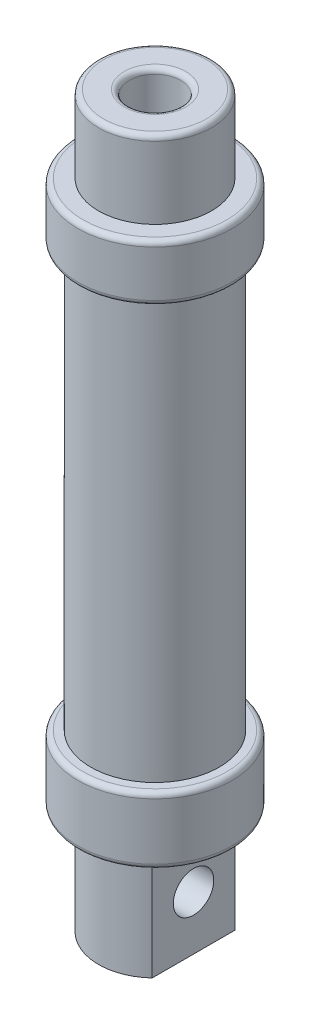
ISO-10303-21;
HEADER;
FILE_DESCRIPTION(('STEP AP214'),'2;1');
FILE_NAME('part.step','',(''),(''),'','','');
FILE_SCHEMA(('AUTOMOTIVE_DESIGN { 1 0 10303 214 1 1 1 1 }'));
ENDSEC;
DATA;
#1=APPLICATION_CONTEXT('core data for automotive mechanical design processes');
#2=APPLICATION_PROTOCOL_DEFINITION('international standard','automotive_design',2000,#1);
#3=PRODUCT_CONTEXT('',#1,'mechanical');
#4=PRODUCT('Part','Part','',(#3));
#5=PRODUCT_RELATED_PRODUCT_CATEGORY('part','',(#4));
#6=PRODUCT_DEFINITION_FORMATION('','',#4);
#7=PRODUCT_DEFINITION_CONTEXT('part definition',#1,'design');
#8=PRODUCT_DEFINITION('design','',#6,#7);
#9=PRODUCT_DEFINITION_SHAPE('','',#8);
#10=(LENGTH_UNIT() NAMED_UNIT(*) SI_UNIT(.MILLI.,.METRE.));
#11=(NAMED_UNIT(*) PLANE_ANGLE_UNIT() SI_UNIT($,.RADIAN.));
#12=(NAMED_UNIT(*) SI_UNIT($,.STERADIAN.) SOLID_ANGLE_UNIT());
#13=UNCERTAINTY_MEASURE_WITH_UNIT(LENGTH_MEASURE(1.E-05),#10,'distance_accuracy_value','');
#14=(GEOMETRIC_REPRESENTATION_CONTEXT(3) GLOBAL_UNCERTAINTY_ASSIGNED_CONTEXT((#13)) GLOBAL_UNIT_ASSIGNED_CONTEXT((#10,
#11,#12)) REPRESENTATION_CONTEXT('',''));
#15=CARTESIAN_POINT('',(0.,0.,0.));
#16=DIRECTION('',(0.,0.,1.));
#17=DIRECTION('',(1.,0.,0.));
#18=AXIS2_PLACEMENT_3D('',#15,#16,#17);
#19=CARTESIAN_POINT('',(0.,108.,0.));
#20=DIRECTION('',(0.,1.,0.));
#21=DIRECTION('',(0.,0.,1.));
#22=AXIS2_PLACEMENT_3D('',#19,#20,#21);
#23=TOROIDAL_SURFACE('',#22,6.,1.);
#24=CARTESIAN_POINT('',(0.,108.,0.));
#25=DIRECTION('',(0.,1.,0.));
#26=DIRECTION('',(0.,0.,1.));
#27=AXIS2_PLACEMENT_3D('',#24,#25,#26);
#28=CIRCLE('',#27,5.);
#29=CARTESIAN_POINT('',(0.,108.,5.));
#30=VERTEX_POINT('',#29);
#31=EDGE_CURVE('E42',#30,#30,#28,.T.);
#32=ORIENTED_EDGE('',*,*,#31,.F.);
#33=EDGE_LOOP('',(#32));
#34=FACE_BOUND('',#33,.T.);
#35=CARTESIAN_POINT('',(0.,109.,0.));
#36=DIRECTION('',(0.,1.,0.));
#37=DIRECTION('',(0.,0.,1.));
#38=AXIS2_PLACEMENT_3D('',#35,#36,#37);
#39=CIRCLE('',#38,6.);
#40=CARTESIAN_POINT('',(0.,109.,6.));
#41=VERTEX_POINT('',#40);
#42=EDGE_CURVE('E11',#41,#41,#39,.F.);
#43=ORIENTED_EDGE('',*,*,#42,.F.);
#44=EDGE_LOOP('',(#43));
#45=FACE_BOUND('',#44,.T.);
#46=ADVANCED_FACE('F35',(#34,#45),#23,.T.);
#47=CARTESIAN_POINT('',(0.,108.,0.));
#48=DIRECTION('',(0.,1.,0.));
#49=DIRECTION('',(0.,0.,1.));
#50=AXIS2_PLACEMENT_3D('',#47,#48,#49);
#51=TOROIDAL_SURFACE('',#50,10.,1.);
#52=CARTESIAN_POINT('',(0.,109.,0.));
#53=DIRECTION('',(0.,1.,0.));
#54=DIRECTION('',(0.,0.,1.));
#55=AXIS2_PLACEMENT_3D('',#52,#53,#54);
#56=CIRCLE('',#55,10.);
#57=CARTESIAN_POINT('',(0.,109.,10.));
#58=VERTEX_POINT('',#57);
#59=EDGE_CURVE('E148',#58,#58,#56,.T.);
#60=ORIENTED_EDGE('',*,*,#59,.F.);
#61=EDGE_LOOP('',(#60));
#62=FACE_BOUND('',#61,.T.);
#63=CARTESIAN_POINT('',(0.,108.,0.));
#64=DIRECTION('',(0.,1.,0.));
#65=DIRECTION('',(0.,0.,1.));
#66=AXIS2_PLACEMENT_3D('',#63,#64,#65);
#67=CIRCLE('',#66,11.);
#68=CARTESIAN_POINT('',(0.,108.,11.));
#69=VERTEX_POINT('',#68);
#70=EDGE_CURVE('E159',#69,#69,#67,.F.);
#71=ORIENTED_EDGE('',*,*,#70,.F.);
#72=EDGE_LOOP('',(#71));
#73=FACE_BOUND('',#72,.T.);
#74=ADVANCED_FACE('F169',(#62,#73),#51,.T.);
#75=CARTESIAN_POINT('',(0.,-11.,0.));
#76=DIRECTION('',(0.,-1.,0.));
#77=DIRECTION('',(0.,0.,-1.));
#78=AXIS2_PLACEMENT_3D('',#75,#76,#77);
#79=PLANE('',#78);
#80=CARTESIAN_POINT('',(0.,-11.,0.));
#81=DIRECTION('',(0.,-1.,0.));
#82=DIRECTION('',(0.,0.,-1.));
#83=AXIS2_PLACEMENT_3D('',#80,#81,#82);
#84=CIRCLE('',#83,11.5527670918556);
#85=CARTESIAN_POINT('',(0.,-11.,-11.5527670918556));
#86=VERTEX_POINT('',#85);
#87=EDGE_CURVE('E145',#86,#86,#84,.F.);
#88=ORIENTED_EDGE('',*,*,#87,.T.);
#89=EDGE_LOOP('',(#88));
#90=FACE_BOUND('',#89,.T.);
#91=ADVANCED_FACE('F181',(#90),#79,.F.);
#92=CARTESIAN_POINT('',(0.,93.,0.));
#93=DIRECTION('',(0.,1.,0.));
#94=DIRECTION('',(0.,0.,1.));
#95=AXIS2_PLACEMENT_3D('',#92,#93,#94);
#96=PLANE('',#95);
#97=CARTESIAN_POINT('',(0.,93.,0.));
#98=DIRECTION('',(0.,1.,0.));
#99=DIRECTION('',(0.,0.,1.));
#100=AXIS2_PLACEMENT_3D('',#97,#98,#99);
#101=CIRCLE('',#100,5.);
#102=CARTESIAN_POINT('',(0.,93.,5.));
#103=VERTEX_POINT('',#102);
#104=EDGE_CURVE('E153',#103,#103,#101,.T.);
#105=ORIENTED_EDGE('',*,*,#104,.T.);
#106=EDGE_LOOP('',(#105));
#107=FACE_BOUND('',#106,.T.);
#108=CARTESIAN_POINT('',(0.,93.,0.));
#109=DIRECTION('',(0.,1.,0.));
#110=DIRECTION('',(0.,0.,1.));
#111=AXIS2_PLACEMENT_3D('',#108,#109,#110);
#112=CIRCLE('',#111,11.5437645875116);
#113=CARTESIAN_POINT('',(0.,93.,11.5437645875116));
#114=VERTEX_POINT('',#113);
#115=EDGE_CURVE('E142',#114,#114,#112,.F.);
#116=ORIENTED_EDGE('',*,*,#115,.T.);
#117=EDGE_LOOP('',(#116));
#118=FACE_BOUND('',#117,.T.);
#119=ADVANCED_FACE('F223',(#107,#118),#96,.F.);
#120=CARTESIAN_POINT('',(0.,83.,0.));
#121=DIRECTION('',(0.,1.,0.));
#122=DIRECTION('',(0.,0.,1.));
#123=AXIS2_PLACEMENT_3D('',#120,#121,#122);
#124=CYLINDRICAL_SURFACE('',#123,11.5437645875116);
#125=CARTESIAN_POINT('',(0.,84.,0.));
#126=DIRECTION('',(0.,1.,0.));
#127=DIRECTION('',(0.,0.,1.));
#128=AXIS2_PLACEMENT_3D('',#125,#126,#127);
#129=CIRCLE('',#128,11.5437645875116);
#130=CARTESIAN_POINT('',(0.,84.,11.5437645875116));
#131=VERTEX_POINT('',#130);
#132=EDGE_CURVE('E107',#131,#131,#129,.T.);
#133=ORIENTED_EDGE('',*,*,#132,.F.);
#134=EDGE_LOOP('',(#133));
#135=FACE_BOUND('',#134,.T.);
#136=ORIENTED_EDGE('',*,*,#115,.F.);
#137=EDGE_LOOP('',(#136));
#138=FACE_BOUND('',#137,.T.);
#139=ADVANCED_FACE('F227',(#135,#138),#124,.F.);
#140=CARTESIAN_POINT('',(0.,84.,0.));
#141=DIRECTION('',(0.,1.,0.));
#142=DIRECTION('',(0.,0.,1.));
#143=AXIS2_PLACEMENT_3D('',#140,#141,#142);
#144=PLANE('',#143);
#145=CARTESIAN_POINT('',(0.,84.,0.));
#146=DIRECTION('',(0.,1.,0.));
#147=DIRECTION('',(0.,0.,1.));
#148=AXIS2_PLACEMENT_3D('',#145,#146,#147);
#149=CIRCLE('',#148,10.5);
#150=CARTESIAN_POINT('',(0.,84.,10.5));
#151=VERTEX_POINT('',#150);
#152=EDGE_CURVE('E100',#151,#151,#149,.T.);
#153=ORIENTED_EDGE('',*,*,#152,.F.);
#154=EDGE_LOOP('',(#153));
#155=FACE_BOUND('',#154,.T.);
#156=ORIENTED_EDGE('',*,*,#132,.T.);
#157=EDGE_LOOP('',(#156));
#158=FACE_BOUND('',#157,.T.);
#159=ADVANCED_FACE('F252',(#155,#158),#144,.T.);
#160=CARTESIAN_POINT('',(0.,84.,0.));
#161=DIRECTION('',(0.,-1.,0.));
#162=DIRECTION('',(0.,0.,-1.));
#163=AXIS2_PLACEMENT_3D('',#160,#161,#162);
#164=CYLINDRICAL_SURFACE('',#163,10.5);
#165=ORIENTED_EDGE('',*,*,#152,.T.);
#166=EDGE_LOOP('',(#165));
#167=FACE_BOUND('',#166,.T.);
#168=CARTESIAN_POINT('',(0.,0.,0.));
#169=DIRECTION('',(0.,1.,0.));
#170=DIRECTION('',(0.,0.,1.));
#171=AXIS2_PLACEMENT_3D('',#168,#169,#170);
#172=CIRCLE('',#171,10.5);
#173=CARTESIAN_POINT('',(0.,0.,10.5));
#174=VERTEX_POINT('',#173);
#175=EDGE_CURVE('E104',#174,#174,#172,.T.);
#176=ORIENTED_EDGE('',*,*,#175,.F.);
#177=EDGE_LOOP('',(#176));
#178=FACE_BOUND('',#177,.T.);
#179=ADVANCED_FACE('F262',(#167,#178),#164,.F.);
#180=CARTESIAN_POINT('',(0.,0.,0.));
#181=DIRECTION('',(0.,1.,0.));
#182=DIRECTION('',(0.,0.,1.));
#183=AXIS2_PLACEMENT_3D('',#180,#181,#182);
#184=PLANE('',#183);
#185=ORIENTED_EDGE('',*,*,#175,.T.);
#186=EDGE_LOOP('',(#185));
#187=FACE_BOUND('',#186,.T.);
#188=CARTESIAN_POINT('',(0.,0.,0.));
#189=DIRECTION('',(0.,1.,0.));
#190=DIRECTION('',(0.,0.,1.));
#191=AXIS2_PLACEMENT_3D('',#188,#189,#190);
#192=CIRCLE('',#191,11.5527670918556);
#193=CARTESIAN_POINT('',(0.,0.,11.5527670918556));
#194=VERTEX_POINT('',#193);
#195=EDGE_CURVE('E110',#194,#194,#192,.T.);
#196=ORIENTED_EDGE('',*,*,#195,.F.);
#197=EDGE_LOOP('',(#196));
#198=FACE_BOUND('',#197,.T.);
#199=ADVANCED_FACE('F236',(#187,#198),#184,.F.);
#200=CARTESIAN_POINT('',(0.,1.,0.));
#201=DIRECTION('',(0.,-1.,0.));
#202=DIRECTION('',(0.,0.,-1.));
#203=AXIS2_PLACEMENT_3D('',#200,#201,#202);
#204=CYLINDRICAL_SURFACE('',#203,11.5527670918556);
#205=ORIENTED_EDGE('',*,*,#195,.T.);
#206=EDGE_LOOP('',(#205));
#207=FACE_BOUND('',#206,.T.);
#208=ORIENTED_EDGE('',*,*,#87,.F.);
#209=EDGE_LOOP('',(#208));
#210=FACE_BOUND('',#209,.T.);
#211=ADVANCED_FACE('F233',(#207,#210),#204,.F.);
#212=CARTESIAN_POINT('',(0.,89.,0.));
#213=DIRECTION('',(0.,1.,0.));
#214=DIRECTION('',(0.,0.,1.));
#215=AXIS2_PLACEMENT_3D('',#212,#213,#214);
#216=CYLINDRICAL_SURFACE('',#215,5.);
#217=ORIENTED_EDGE('',*,*,#31,.T.);
#218=EDGE_LOOP('',(#217));
#219=FACE_BOUND('',#218,.T.);
#220=ORIENTED_EDGE('',*,*,#104,.F.);
#221=EDGE_LOOP('',(#220));
#222=FACE_BOUND('',#221,.T.);
#223=ADVANCED_FACE('F164',(#219,#222),#216,.F.);
#224=CARTESIAN_POINT('',(0.,94.,0.));
#225=DIRECTION('',(0.,1.,0.));
#226=DIRECTION('',(0.,0.,1.));
#227=AXIS2_PLACEMENT_3D('',#224,#225,#226);
#228=PLANE('',#227);
#229=CARTESIAN_POINT('',(0.,94.,0.));
#230=DIRECTION('',(0.,1.,0.));
#231=DIRECTION('',(0.,0.,1.));
#232=AXIS2_PLACEMENT_3D('',#229,#230,#231);
#233=CIRCLE('',#232,14.);
#234=CARTESIAN_POINT('',(0.,94.,14.));
#235=VERTEX_POINT('',#234);
#236=EDGE_CURVE('E130',#235,#235,#233,.T.);
#237=ORIENTED_EDGE('',*,*,#236,.T.);
#238=EDGE_LOOP('',(#237));
#239=FACE_BOUND('',#238,.T.);
#240=CARTESIAN_POINT('',(0.,94.,0.));
#241=DIRECTION('',(0.,1.,0.));
#242=DIRECTION('',(0.,0.,1.));
#243=AXIS2_PLACEMENT_3D('',#240,#241,#242);
#244=CIRCLE('',#243,11.);
#245=CARTESIAN_POINT('',(0.,94.,11.));
#246=VERTEX_POINT('',#245);
#247=EDGE_CURVE('E156',#246,#246,#244,.T.);
#248=ORIENTED_EDGE('',*,*,#247,.F.);
#249=EDGE_LOOP('',(#248));
#250=FACE_BOUND('',#249,.T.);
#251=ADVANCED_FACE('F246',(#239,#250),#228,.T.);
#252=CARTESIAN_POINT('',(0.,-33.,0.));
#253=DIRECTION('',(0.,1.,0.));
#254=DIRECTION('',(0.,0.,1.));
#255=AXIS2_PLACEMENT_3D('',#252,#253,#254);
#256=CYLINDRICAL_SURFACE('',#255,11.);
#257=CARTESIAN_POINT('',(0.,-33.,0.));
#258=DIRECTION('',(0.,-1.,0.));
#259=DIRECTION('',(0.,0.,-1.));
#260=AXIS2_PLACEMENT_3D('',#257,#258,#259);
#261=CIRCLE('',#260,11.);
#262=CARTESIAN_POINT('',(7.5,-33.,8.04673846971554));
#263=VERTEX_POINT('',#262);
#264=CARTESIAN_POINT('',(-7.5,-33.,8.04673846971554));
#265=VERTEX_POINT('',#264);
#266=EDGE_CURVE('E93',#263,#265,#261,.T.);
#267=ORIENTED_EDGE('',*,*,#266,.F.);
#268=DIRECTION('',(0.,-1.,0.));
#269=VECTOR('',#268,1.);
#270=CARTESIAN_POINT('',(7.5,-12.,8.04673846971554));
#271=LINE('',#270,#269);
#272=CARTESIAN_POINT('',(7.5,-12.,8.04673846971554));
#273=VERTEX_POINT('',#272);
#274=EDGE_CURVE('E49',#273,#263,#271,.T.);
#275=ORIENTED_EDGE('',*,*,#274,.F.);
#276=CARTESIAN_POINT('',(0.,-12.,0.));
#277=DIRECTION('',(0.,-1.,0.));
#278=DIRECTION('',(0.,0.,-1.));
#279=AXIS2_PLACEMENT_3D('',#276,#277,#278);
#280=CIRCLE('',#279,11.);
#281=CARTESIAN_POINT('',(-7.5,-12.,8.04673846971554));
#282=VERTEX_POINT('',#281);
#283=EDGE_CURVE('E82',#273,#282,#280,.T.);
#284=ORIENTED_EDGE('',*,*,#283,.T.);
#285=DIRECTION('',(0.,-1.,0.));
#286=VECTOR('',#285,1.);
#287=CARTESIAN_POINT('',(-7.5,-12.,8.04673846971554));
#288=LINE('',#287,#286);
#289=EDGE_CURVE('E97',#282,#265,#288,.T.);
#290=ORIENTED_EDGE('',*,*,#289,.T.);
#291=EDGE_LOOP('',(#267,#275,#284,#290));
#292=FACE_BOUND('',#291,.T.);
#293=ADVANCED_FACE('F205',(#292),#256,.T.);
#294=CARTESIAN_POINT('',(0.,-12.,0.));
#295=DIRECTION('',(0.,-1.,0.));
#296=DIRECTION('',(0.,0.,-1.));
#297=AXIS2_PLACEMENT_3D('',#294,#295,#296);
#298=PLANE('',#297);
#299=CARTESIAN_POINT('',(0.,-12.,0.));
#300=DIRECTION('',(0.,-1.,0.));
#301=DIRECTION('',(0.,0.,-1.));
#302=AXIS2_PLACEMENT_3D('',#299,#300,#301);
#303=CIRCLE('',#302,14.);
#304=CARTESIAN_POINT('',(0.,-12.,-14.));
#305=VERTEX_POINT('',#304);
#306=EDGE_CURVE('E139',#305,#305,#303,.T.);
#307=ORIENTED_EDGE('',*,*,#306,.T.);
#308=EDGE_LOOP('',(#307));
#309=FACE_BOUND('',#308,.T.);
#310=CARTESIAN_POINT('',(-7.5,-12.,-8.04673846971554));
#311=VERTEX_POINT('',#310);
#312=CARTESIAN_POINT('',(7.5,-12.,-8.04673846971554));
#313=VERTEX_POINT('',#312);
#314=EDGE_CURVE('E81',#311,#313,#280,.T.);
#315=ORIENTED_EDGE('',*,*,#314,.F.);
#316=DIRECTION('',(0.,0.,1.));
#317=VECTOR('',#316,1.);
#318=CARTESIAN_POINT('',(-7.5,-12.,0.));
#319=LINE('',#318,#317);
#320=EDGE_CURVE('E198',#311,#282,#319,.T.);
#321=ORIENTED_EDGE('',*,*,#320,.T.);
#322=ORIENTED_EDGE('',*,*,#283,.F.);
#323=DIRECTION('',(0.,0.,-1.));
#324=VECTOR('',#323,1.);
#325=CARTESIAN_POINT('',(7.5,-12.,8.04673846971554));
#326=LINE('',#325,#324);
#327=EDGE_CURVE('E76',#273,#313,#326,.T.);
#328=ORIENTED_EDGE('',*,*,#327,.T.);
#329=EDGE_LOOP('',(#315,#321,#322,#328));
#330=FACE_BOUND('',#329,.T.);
#331=ADVANCED_FACE('F78',(#309,#330),#298,.T.);
#332=CARTESIAN_POINT('',(0.,-11.,0.));
#333=DIRECTION('',(0.,-1.,0.));
#334=DIRECTION('',(0.,0.,-1.));
#335=AXIS2_PLACEMENT_3D('',#332,#333,#334);
#336=TOROIDAL_SURFACE('',#335,14.,1.);
#337=CARTESIAN_POINT('',(0.,-11.,0.));
#338=DIRECTION('',(0.,-1.,0.));
#339=DIRECTION('',(0.,0.,-1.));
#340=AXIS2_PLACEMENT_3D('',#337,#338,#339);
#341=CIRCLE('',#340,15.);
#342=CARTESIAN_POINT('',(0.,-11.,-15.));
#343=VERTEX_POINT('',#342);
#344=EDGE_CURVE('E136',#343,#343,#341,.F.);
#345=ORIENTED_EDGE('',*,*,#344,.F.);
#346=EDGE_LOOP('',(#345));
#347=FACE_BOUND('',#346,.T.);
#348=ORIENTED_EDGE('',*,*,#306,.F.);
#349=EDGE_LOOP('',(#348));
#350=FACE_BOUND('',#349,.T.);
#351=ADVANCED_FACE('F231',(#347,#350),#336,.T.);
#352=CARTESIAN_POINT('',(0.,93.,0.));
#353=DIRECTION('',(0.,1.,0.));
#354=DIRECTION('',(0.,0.,1.));
#355=AXIS2_PLACEMENT_3D('',#352,#353,#354);
#356=TOROIDAL_SURFACE('',#355,14.,1.);
#357=ORIENTED_EDGE('',*,*,#236,.F.);
#358=EDGE_LOOP('',(#357));
#359=FACE_BOUND('',#358,.T.);
#360=CARTESIAN_POINT('',(0.,93.,0.));
#361=DIRECTION('',(0.,1.,0.));
#362=DIRECTION('',(0.,0.,1.));
#363=AXIS2_PLACEMENT_3D('',#360,#361,#362);
#364=CIRCLE('',#363,15.);
#365=CARTESIAN_POINT('',(0.,93.,15.));
#366=VERTEX_POINT('',#365);
#367=EDGE_CURVE('E133',#366,#366,#364,.F.);
#368=ORIENTED_EDGE('',*,*,#367,.F.);
#369=EDGE_LOOP('',(#368));
#370=FACE_BOUND('',#369,.T.);
#371=ADVANCED_FACE('F282',(#359,#370),#356,.T.);
#372=CARTESIAN_POINT('',(0.,0.,0.));
#373=DIRECTION('',(0.,-1.,0.));
#374=DIRECTION('',(0.,0.,-1.));
#375=AXIS2_PLACEMENT_3D('',#372,#373,#374);
#376=TOROIDAL_SURFACE('',#375,14.,1.);
#377=CARTESIAN_POINT('',(0.,0.,0.));
#378=DIRECTION('',(0.,-1.,0.));
#379=DIRECTION('',(0.,0.,-1.));
#380=AXIS2_PLACEMENT_3D('',#377,#378,#379);
#381=CIRCLE('',#380,15.);
#382=CARTESIAN_POINT('',(0.,0.,-15.));
#383=VERTEX_POINT('',#382);
#384=EDGE_CURVE('E124',#383,#383,#381,.T.);
#385=ORIENTED_EDGE('',*,*,#384,.F.);
#386=EDGE_LOOP('',(#385));
#387=FACE_BOUND('',#386,.T.);
#388=CARTESIAN_POINT('',(0.,1.,0.));
#389=DIRECTION('',(0.,-1.,0.));
#390=DIRECTION('',(0.,0.,-1.));
#391=AXIS2_PLACEMENT_3D('',#388,#389,#390);
#392=CIRCLE('',#391,14.);
#393=CARTESIAN_POINT('',(0.,1.,-14.));
#394=VERTEX_POINT('',#393);
#395=EDGE_CURVE('E127',#394,#394,#392,.F.);
#396=ORIENTED_EDGE('',*,*,#395,.F.);
#397=EDGE_LOOP('',(#396));
#398=FACE_BOUND('',#397,.T.);
#399=ADVANCED_FACE('F278',(#387,#398),#376,.T.);
#400=CARTESIAN_POINT('',(0.,84.,0.));
#401=DIRECTION('',(0.,1.,0.));
#402=DIRECTION('',(0.,0.,1.));
#403=AXIS2_PLACEMENT_3D('',#400,#401,#402);
#404=TOROIDAL_SURFACE('',#403,14.,1.);
#405=CARTESIAN_POINT('',(0.,84.,0.));
#406=DIRECTION('',(0.,1.,0.));
#407=DIRECTION('',(0.,0.,1.));
#408=AXIS2_PLACEMENT_3D('',#405,#406,#407);
#409=CIRCLE('',#408,15.);
#410=CARTESIAN_POINT('',(0.,84.,15.));
#411=VERTEX_POINT('',#410);
#412=EDGE_CURVE('E118',#411,#411,#409,.T.);
#413=ORIENTED_EDGE('',*,*,#412,.F.);
#414=EDGE_LOOP('',(#413));
#415=FACE_BOUND('',#414,.T.);
#416=CARTESIAN_POINT('',(0.,83.,0.));
#417=DIRECTION('',(0.,1.,0.));
#418=DIRECTION('',(0.,0.,1.));
#419=AXIS2_PLACEMENT_3D('',#416,#417,#418);
#420=CIRCLE('',#419,14.);
#421=CARTESIAN_POINT('',(0.,83.,14.));
#422=VERTEX_POINT('',#421);
#423=EDGE_CURVE('E121',#422,#422,#420,.F.);
#424=ORIENTED_EDGE('',*,*,#423,.F.);
#425=EDGE_LOOP('',(#424));
#426=FACE_BOUND('',#425,.T.);
#427=ADVANCED_FACE('F274',(#415,#426),#404,.T.);
#428=CARTESIAN_POINT('',(0.,84.,0.));
#429=DIRECTION('',(0.,-1.,0.));
#430=DIRECTION('',(0.,0.,-1.));
#431=AXIS2_PLACEMENT_3D('',#428,#429,#430);
#432=CYLINDRICAL_SURFACE('',#431,12.5);
#433=CARTESIAN_POINT('',(0.,83.,0.));
#434=DIRECTION('',(0.,1.,0.));
#435=DIRECTION('',(0.,0.,1.));
#436=AXIS2_PLACEMENT_3D('',#433,#434,#435);
#437=CIRCLE('',#436,12.5);
#438=CARTESIAN_POINT('',(0.,83.,12.5));
#439=VERTEX_POINT('',#438);
#440=EDGE_CURVE('E103',#439,#439,#437,.T.);
#441=ORIENTED_EDGE('',*,*,#440,.F.);
#442=EDGE_LOOP('',(#441));
#443=FACE_BOUND('',#442,.T.);
#444=CARTESIAN_POINT('',(0.,1.,0.));
#445=DIRECTION('',(0.,-1.,0.));
#446=DIRECTION('',(0.,0.,-1.));
#447=AXIS2_PLACEMENT_3D('',#444,#445,#446);
#448=CIRCLE('',#447,12.5);
#449=CARTESIAN_POINT('',(0.,1.,-12.5));
#450=VERTEX_POINT('',#449);
#451=EDGE_CURVE('E115',#450,#450,#448,.T.);
#452=ORIENTED_EDGE('',*,*,#451,.F.);
#453=EDGE_LOOP('',(#452));
#454=FACE_BOUND('',#453,.T.);
#455=ADVANCED_FACE('F257',(#443,#454),#432,.T.);
#456=CARTESIAN_POINT('',(0.,83.,0.));
#457=DIRECTION('',(0.,1.,0.));
#458=DIRECTION('',(0.,0.,1.));
#459=AXIS2_PLACEMENT_3D('',#456,#457,#458);
#460=PLANE('',#459);
#461=ORIENTED_EDGE('',*,*,#423,.T.);
#462=EDGE_LOOP('',(#461));
#463=FACE_BOUND('',#462,.T.);
#464=ORIENTED_EDGE('',*,*,#440,.T.);
#465=EDGE_LOOP('',(#464));
#466=FACE_BOUND('',#465,.T.);
#467=ADVANCED_FACE('F254',(#463,#466),#460,.F.);
#468=CARTESIAN_POINT('',(0.,83.,0.));
#469=DIRECTION('',(0.,1.,0.));
#470=DIRECTION('',(0.,0.,1.));
#471=AXIS2_PLACEMENT_3D('',#468,#469,#470);
#472=CYLINDRICAL_SURFACE('',#471,15.);
#473=ORIENTED_EDGE('',*,*,#367,.T.);
#474=EDGE_LOOP('',(#473));
#475=FACE_BOUND('',#474,.T.);
#476=ORIENTED_EDGE('',*,*,#412,.T.);
#477=EDGE_LOOP('',(#476));
#478=FACE_BOUND('',#477,.T.);
#479=ADVANCED_FACE('F241',(#475,#478),#472,.T.);
#480=CARTESIAN_POINT('',(0.,1.,0.));
#481=DIRECTION('',(0.,-1.,0.));
#482=DIRECTION('',(0.,0.,-1.));
#483=AXIS2_PLACEMENT_3D('',#480,#481,#482);
#484=PLANE('',#483);
#485=ORIENTED_EDGE('',*,*,#395,.T.);
#486=EDGE_LOOP('',(#485));
#487=FACE_BOUND('',#486,.T.);
#488=ORIENTED_EDGE('',*,*,#451,.T.);
#489=EDGE_LOOP('',(#488));
#490=FACE_BOUND('',#489,.T.);
#491=ADVANCED_FACE('F238',(#487,#490),#484,.F.);
#492=CARTESIAN_POINT('',(0.,1.,0.));
#493=DIRECTION('',(0.,-1.,0.));
#494=DIRECTION('',(0.,0.,-1.));
#495=AXIS2_PLACEMENT_3D('',#492,#493,#494);
#496=CYLINDRICAL_SURFACE('',#495,15.);
#497=ORIENTED_EDGE('',*,*,#344,.T.);
#498=EDGE_LOOP('',(#497));
#499=FACE_BOUND('',#498,.T.);
#500=ORIENTED_EDGE('',*,*,#384,.T.);
#501=EDGE_LOOP('',(#500));
#502=FACE_BOUND('',#501,.T.);
#503=ADVANCED_FACE('F217',(#499,#502),#496,.T.);
#504=ORIENTED_EDGE('',*,*,#314,.T.);
#505=DIRECTION('',(0.,-1.,0.));
#506=VECTOR('',#505,1.);
#507=CARTESIAN_POINT('',(7.5,-12.,-8.04673846971554));
#508=LINE('',#507,#506);
#509=CARTESIAN_POINT('',(7.5,-33.,-8.04673846971554));
#510=VERTEX_POINT('',#509);
#511=EDGE_CURVE('E83',#313,#510,#508,.T.);
#512=ORIENTED_EDGE('',*,*,#511,.T.);
#513=CARTESIAN_POINT('',(-7.5,-33.,-8.04673846971554));
#514=VERTEX_POINT('',#513);
#515=EDGE_CURVE('E95',#514,#510,#261,.T.);
#516=ORIENTED_EDGE('',*,*,#515,.F.);
#517=DIRECTION('',(0.,-1.,0.));
#518=VECTOR('',#517,1.);
#519=CARTESIAN_POINT('',(-7.5,-12.,-8.04673846971554));
#520=LINE('',#519,#518);
#521=EDGE_CURVE('E57',#311,#514,#520,.T.);
#522=ORIENTED_EDGE('',*,*,#521,.F.);
#523=EDGE_LOOP('',(#504,#512,#516,#522));
#524=FACE_BOUND('',#523,.T.);
#525=ADVANCED_FACE('F92',(#524),#256,.T.);
#526=CARTESIAN_POINT('',(0.,-33.,0.));
#527=DIRECTION('',(0.,-1.,0.));
#528=DIRECTION('',(0.,0.,-1.));
#529=AXIS2_PLACEMENT_3D('',#526,#527,#528);
#530=PLANE('',#529);
#531=DIRECTION('',(0.,0.,-1.));
#532=VECTOR('',#531,1.);
#533=CARTESIAN_POINT('',(7.5,-33.,0.));
#534=LINE('',#533,#532);
#535=EDGE_CURVE('E84',#263,#510,#534,.T.);
#536=ORIENTED_EDGE('',*,*,#535,.F.);
#537=ORIENTED_EDGE('',*,*,#266,.T.);
#538=DIRECTION('',(0.,0.,1.));
#539=VECTOR('',#538,1.);
#540=CARTESIAN_POINT('',(-7.5,-33.,8.04673846971554));
#541=LINE('',#540,#539);
#542=EDGE_CURVE('E196',#514,#265,#541,.T.);
#543=ORIENTED_EDGE('',*,*,#542,.F.);
#544=ORIENTED_EDGE('',*,*,#515,.T.);
#545=EDGE_LOOP('',(#536,#537,#543,#544));
#546=FACE_BOUND('',#545,.T.);
#547=ADVANCED_FACE('F208',(#546),#530,.T.);
#548=CARTESIAN_POINT('',(-7.5,-12.,8.04673846971554));
#549=DIRECTION('',(1.,0.,0.));
#550=DIRECTION('',(0.,0.,-1.));
#551=AXIS2_PLACEMENT_3D('',#548,#549,#550);
#552=PLANE('',#551);
#553=CARTESIAN_POINT('',(-7.5,-22.5,0.));
#554=DIRECTION('',(-1.,0.,0.));
#555=DIRECTION('',(0.,0.,1.));
#556=AXIS2_PLACEMENT_3D('',#553,#554,#555);
#557=CIRCLE('',#556,3.935);
#558=CARTESIAN_POINT('',(-7.5,-22.5,3.935));
#559=VERTEX_POINT('',#558);
#560=EDGE_CURVE('E152',#559,#559,#557,.T.);
#561=ORIENTED_EDGE('',*,*,#560,.F.);
#562=EDGE_LOOP('',(#561));
#563=FACE_BOUND('',#562,.T.);
#564=ORIENTED_EDGE('',*,*,#542,.T.);
#565=ORIENTED_EDGE('',*,*,#289,.F.);
#566=ORIENTED_EDGE('',*,*,#320,.F.);
#567=ORIENTED_EDGE('',*,*,#521,.T.);
#568=EDGE_LOOP('',(#564,#565,#566,#567));
#569=FACE_BOUND('',#568,.T.);
#570=ADVANCED_FACE('F206',(#563,#569),#552,.F.);
#571=CARTESIAN_POINT('',(7.5,-12.,0.));
#572=DIRECTION('',(-1.,0.,0.));
#573=DIRECTION('',(0.,0.,1.));
#574=AXIS2_PLACEMENT_3D('',#571,#572,#573);
#575=PLANE('',#574);
#576=CARTESIAN_POINT('',(7.5,-22.5,0.));
#577=DIRECTION('',(-1.,0.,0.));
#578=DIRECTION('',(0.,0.,1.));
#579=AXIS2_PLACEMENT_3D('',#576,#577,#578);
#580=CIRCLE('',#579,3.935);
#581=CARTESIAN_POINT('',(7.5,-22.5,3.935));
#582=VERTEX_POINT('',#581);
#583=EDGE_CURVE('E149',#582,#582,#580,.T.);
#584=ORIENTED_EDGE('',*,*,#583,.T.);
#585=EDGE_LOOP('',(#584));
#586=FACE_BOUND('',#585,.T.);
#587=ORIENTED_EDGE('',*,*,#535,.T.);
#588=ORIENTED_EDGE('',*,*,#511,.F.);
#589=ORIENTED_EDGE('',*,*,#327,.F.);
#590=ORIENTED_EDGE('',*,*,#274,.T.);
#591=EDGE_LOOP('',(#587,#588,#589,#590));
#592=FACE_BOUND('',#591,.T.);
#593=ADVANCED_FACE('F87',(#586,#592),#575,.F.);
#594=CARTESIAN_POINT('',(15.,-22.5,0.));
#595=DIRECTION('',(-1.,0.,0.));
#596=DIRECTION('',(0.,0.,1.));
#597=AXIS2_PLACEMENT_3D('',#594,#595,#596);
#598=CYLINDRICAL_SURFACE('',#597,3.935);
#599=ORIENTED_EDGE('',*,*,#560,.T.);
#600=EDGE_LOOP('',(#599));
#601=FACE_BOUND('',#600,.T.);
#602=ORIENTED_EDGE('',*,*,#583,.F.);
#603=EDGE_LOOP('',(#602));
#604=FACE_BOUND('',#603,.T.);
#605=ADVANCED_FACE('F186',(#601,#604),#598,.F.);
#606=CARTESIAN_POINT('',(0.,109.,0.));
#607=DIRECTION('',(0.,-1.,0.));
#608=DIRECTION('',(0.,0.,-1.));
#609=AXIS2_PLACEMENT_3D('',#606,#607,#608);
#610=CYLINDRICAL_SURFACE('',#609,11.);
#611=ORIENTED_EDGE('',*,*,#70,.T.);
#612=EDGE_LOOP('',(#611));
#613=FACE_BOUND('',#612,.T.);
#614=ORIENTED_EDGE('',*,*,#247,.T.);
#615=EDGE_LOOP('',(#614));
#616=FACE_BOUND('',#615,.T.);
#617=ADVANCED_FACE('F175',(#613,#616),#610,.T.);
#618=CARTESIAN_POINT('',(0.,109.,0.));
#619=DIRECTION('',(0.,1.,0.));
#620=DIRECTION('',(0.,0.,1.));
#621=AXIS2_PLACEMENT_3D('',#618,#619,#620);
#622=PLANE('',#621);
#623=ORIENTED_EDGE('',*,*,#42,.T.);
#624=EDGE_LOOP('',(#623));
#625=FACE_BOUND('',#624,.T.);
#626=ORIENTED_EDGE('',*,*,#59,.T.);
#627=EDGE_LOOP('',(#626));
#628=FACE_BOUND('',#627,.T.);
#629=ADVANCED_FACE('F172',(#625,#628),#622,.T.);
#630=CLOSED_SHELL('',(#46,#74,#91,#119,#139,#159,#179,#199,#211,#223,#251,#293,#331,#351,#371,
#399,#427,#455,#467,#479,#491,#503,#525,#547,#570,#593,#605,#617,#629));
#631=MANIFOLD_SOLID_BREP('B2',#630);
#632=ADVANCED_BREP_SHAPE_REPRESENTATION('',(#18,#631),#14);
#633=SHAPE_DEFINITION_REPRESENTATION(#9,#632);
ENDSEC;
END-ISO-10303-21;
